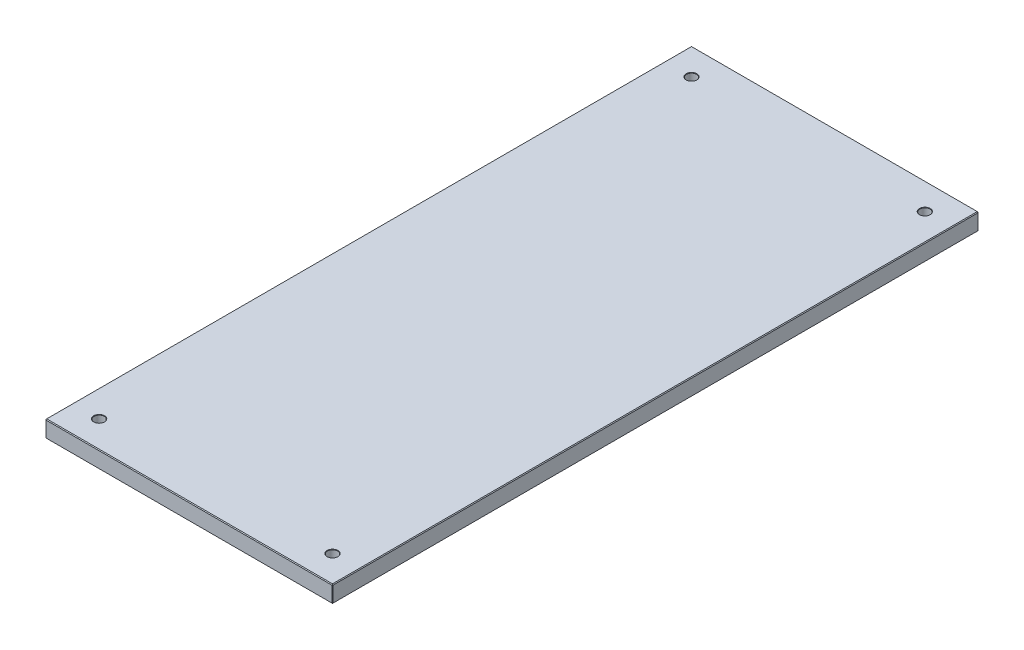
ISO-10303-21;
HEADER;
FILE_DESCRIPTION(('STEP AP214'),'2;1');
FILE_NAME('part.step','',(''),(''),'','','');
FILE_SCHEMA(('AUTOMOTIVE_DESIGN { 1 0 10303 214 1 1 1 1 }'));
ENDSEC;
DATA;
#1=APPLICATION_CONTEXT('core data for automotive mechanical design processes');
#2=APPLICATION_PROTOCOL_DEFINITION('international standard','automotive_design',2000,#1);
#3=PRODUCT_CONTEXT('',#1,'mechanical');
#4=PRODUCT('Part','Part','',(#3));
#5=PRODUCT_RELATED_PRODUCT_CATEGORY('part','',(#4));
#6=PRODUCT_DEFINITION_FORMATION('','',#4);
#7=PRODUCT_DEFINITION_CONTEXT('part definition',#1,'design');
#8=PRODUCT_DEFINITION('design','',#6,#7);
#9=PRODUCT_DEFINITION_SHAPE('','',#8);
#10=(LENGTH_UNIT() NAMED_UNIT(*) SI_UNIT(.MILLI.,.METRE.));
#11=(NAMED_UNIT(*) PLANE_ANGLE_UNIT() SI_UNIT($,.RADIAN.));
#12=(NAMED_UNIT(*) SI_UNIT($,.STERADIAN.) SOLID_ANGLE_UNIT());
#13=UNCERTAINTY_MEASURE_WITH_UNIT(LENGTH_MEASURE(1.E-05),#10,'distance_accuracy_value','');
#14=(GEOMETRIC_REPRESENTATION_CONTEXT(3) GLOBAL_UNCERTAINTY_ASSIGNED_CONTEXT((#13)) GLOBAL_UNIT_ASSIGNED_CONTEXT((#10,
#11,#12)) REPRESENTATION_CONTEXT('',''));
#15=CARTESIAN_POINT('',(0.,0.,0.));
#16=DIRECTION('',(0.,0.,1.));
#17=DIRECTION('',(1.,0.,0.));
#18=AXIS2_PLACEMENT_3D('',#15,#16,#17);
#19=CARTESIAN_POINT('',(101.6,6.,228.6));
#20=DIRECTION('',(-1.,0.,0.));
#21=DIRECTION('',(0.,0.,1.));
#22=AXIS2_PLACEMENT_3D('',#19,#20,#21);
#23=PLANE('',#22);
#24=DIRECTION('',(0.,0.,-1.));
#25=VECTOR('',#24,1.);
#26=CARTESIAN_POINT('',(101.6,-5.49199999999999,-228.6));
#27=LINE('',#26,#25);
#28=CARTESIAN_POINT('',(101.6,-5.49199999999999,228.092));
#29=VERTEX_POINT('',#28);
#30=CARTESIAN_POINT('',(101.6,-5.49199999999999,-228.092));
#31=VERTEX_POINT('',#30);
#32=EDGE_CURVE('E193',#29,#31,#27,.T.);
#33=ORIENTED_EDGE('',*,*,#32,.T.);
#34=DIRECTION('',(0.,1.,0.));
#35=VECTOR('',#34,1.);
#36=CARTESIAN_POINT('',(101.6,6.,-228.092));
#37=LINE('',#36,#35);
#38=CARTESIAN_POINT('',(101.6,5.49199999999999,-228.092));
#39=VERTEX_POINT('',#38);
#40=EDGE_CURVE('E200',#31,#39,#37,.T.);
#41=ORIENTED_EDGE('',*,*,#40,.T.);
#42=DIRECTION('',(0.,0.,1.));
#43=VECTOR('',#42,1.);
#44=CARTESIAN_POINT('',(101.6,5.49199999999999,228.6));
#45=LINE('',#44,#43);
#46=CARTESIAN_POINT('',(101.6,5.49199999999999,228.092));
#47=VERTEX_POINT('',#46);
#48=EDGE_CURVE('E196',#39,#47,#45,.T.);
#49=ORIENTED_EDGE('',*,*,#48,.T.);
#50=DIRECTION('',(0.,-1.,0.));
#51=VECTOR('',#50,1.);
#52=CARTESIAN_POINT('',(101.6,6.,228.092));
#53=LINE('',#52,#51);
#54=EDGE_CURVE('E190',#47,#29,#53,.T.);
#55=ORIENTED_EDGE('',*,*,#54,.T.);
#56=EDGE_LOOP('',(#33,#41,#49,#55));
#57=FACE_BOUND('',#56,.T.);
#58=ADVANCED_FACE('F47',(#57),#23,.F.);
#59=CARTESIAN_POINT('',(-101.6,6.,-228.6));
#60=DIRECTION('',(0.,0.,1.));
#61=DIRECTION('',(1.,0.,0.));
#62=AXIS2_PLACEMENT_3D('',#59,#60,#61);
#63=PLANE('',#62);
#64=DIRECTION('',(1.,0.,0.));
#65=VECTOR('',#64,1.);
#66=CARTESIAN_POINT('',(-101.6,5.49199999999999,-228.6));
#67=LINE('',#66,#65);
#68=CARTESIAN_POINT('',(-101.092,5.49199999999999,-228.6));
#69=VERTEX_POINT('',#68);
#70=CARTESIAN_POINT('',(101.092,5.49199999999999,-228.6));
#71=VERTEX_POINT('',#70);
#72=EDGE_CURVE('E222',#69,#71,#67,.T.);
#73=ORIENTED_EDGE('',*,*,#72,.T.);
#74=DIRECTION('',(0.,-1.,0.));
#75=VECTOR('',#74,1.);
#76=CARTESIAN_POINT('',(101.092,6.,-228.6));
#77=LINE('',#76,#75);
#78=CARTESIAN_POINT('',(101.092,-5.49199999999999,-228.6));
#79=VERTEX_POINT('',#78);
#80=EDGE_CURVE('E225',#71,#79,#77,.T.);
#81=ORIENTED_EDGE('',*,*,#80,.T.);
#82=DIRECTION('',(-1.,0.,0.));
#83=VECTOR('',#82,1.);
#84=CARTESIAN_POINT('',(-101.6,-5.49199999999999,-228.6));
#85=LINE('',#84,#83);
#86=CARTESIAN_POINT('',(-101.092,-5.49199999999999,-228.6));
#87=VERTEX_POINT('',#86);
#88=EDGE_CURVE('E219',#79,#87,#85,.T.);
#89=ORIENTED_EDGE('',*,*,#88,.T.);
#90=DIRECTION('',(0.,1.,0.));
#91=VECTOR('',#90,1.);
#92=CARTESIAN_POINT('',(-101.092,6.,-228.6));
#93=LINE('',#92,#91);
#94=EDGE_CURVE('E216',#87,#69,#93,.T.);
#95=ORIENTED_EDGE('',*,*,#94,.T.);
#96=EDGE_LOOP('',(#73,#81,#89,#95));
#97=FACE_BOUND('',#96,.T.);
#98=ADVANCED_FACE('F414',(#97),#63,.F.);
#99=CARTESIAN_POINT('',(-101.6,6.,228.6));
#100=DIRECTION('',(1.,0.,0.));
#101=DIRECTION('',(0.,0.,-1.));
#102=AXIS2_PLACEMENT_3D('',#99,#100,#101);
#103=PLANE('',#102);
#104=DIRECTION('',(0.,0.,-1.));
#105=VECTOR('',#104,1.);
#106=CARTESIAN_POINT('',(-101.6,5.49199999999999,228.6));
#107=LINE('',#106,#105);
#108=CARTESIAN_POINT('',(-101.6,5.49199999999999,228.092));
#109=VERTEX_POINT('',#108);
#110=CARTESIAN_POINT('',(-101.6,5.49199999999999,-228.092));
#111=VERTEX_POINT('',#110);
#112=EDGE_CURVE('E156',#109,#111,#107,.T.);
#113=ORIENTED_EDGE('',*,*,#112,.T.);
#114=DIRECTION('',(0.,-1.,0.));
#115=VECTOR('',#114,1.);
#116=CARTESIAN_POINT('',(-101.6,6.,-228.092));
#117=LINE('',#116,#115);
#118=CARTESIAN_POINT('',(-101.6,-5.49199999999999,-228.092));
#119=VERTEX_POINT('',#118);
#120=EDGE_CURVE('E237',#111,#119,#117,.T.);
#121=ORIENTED_EDGE('',*,*,#120,.T.);
#122=DIRECTION('',(0.,0.,1.));
#123=VECTOR('',#122,1.);
#124=CARTESIAN_POINT('',(-101.6,-5.49199999999999,228.6));
#125=LINE('',#124,#123);
#126=CARTESIAN_POINT('',(-101.6,-5.49199999999999,228.092));
#127=VERTEX_POINT('',#126);
#128=EDGE_CURVE('E232',#119,#127,#125,.T.);
#129=ORIENTED_EDGE('',*,*,#128,.T.);
#130=DIRECTION('',(0.,1.,0.));
#131=VECTOR('',#130,1.);
#132=CARTESIAN_POINT('',(-101.6,6.,228.092));
#133=LINE('',#132,#131);
#134=EDGE_CURVE('E229',#127,#109,#133,.T.);
#135=ORIENTED_EDGE('',*,*,#134,.T.);
#136=EDGE_LOOP('',(#113,#121,#129,#135));
#137=FACE_BOUND('',#136,.T.);
#138=ADVANCED_FACE('F410',(#137),#103,.F.);
#139=CARTESIAN_POINT('',(-101.6,6.,228.6));
#140=DIRECTION('',(0.,0.,-1.));
#141=DIRECTION('',(-1.,0.,0.));
#142=AXIS2_PLACEMENT_3D('',#139,#140,#141);
#143=PLANE('',#142);
#144=DIRECTION('',(-1.,0.,0.));
#145=VECTOR('',#144,1.);
#146=CARTESIAN_POINT('',(-101.6,5.49199999999999,228.6));
#147=LINE('',#146,#145);
#148=CARTESIAN_POINT('',(101.092,5.49199999999999,228.6));
#149=VERTEX_POINT('',#148);
#150=CARTESIAN_POINT('',(-101.092,5.49199999999999,228.6));
#151=VERTEX_POINT('',#150);
#152=EDGE_CURVE('E58',#149,#151,#147,.T.);
#153=ORIENTED_EDGE('',*,*,#152,.T.);
#154=DIRECTION('',(0.,-1.,0.));
#155=VECTOR('',#154,1.);
#156=CARTESIAN_POINT('',(-101.092,6.,228.6));
#157=LINE('',#156,#155);
#158=CARTESIAN_POINT('',(-101.092,-5.49199999999999,228.6));
#159=VERTEX_POINT('',#158);
#160=EDGE_CURVE('E11',#151,#159,#157,.T.);
#161=ORIENTED_EDGE('',*,*,#160,.T.);
#162=DIRECTION('',(1.,0.,0.));
#163=VECTOR('',#162,1.);
#164=CARTESIAN_POINT('',(101.6,-5.49199999999999,228.6));
#165=LINE('',#164,#163);
#166=CARTESIAN_POINT('',(101.092,-5.49199999999999,228.6));
#167=VERTEX_POINT('',#166);
#168=EDGE_CURVE('E241',#159,#167,#165,.T.);
#169=ORIENTED_EDGE('',*,*,#168,.T.);
#170=DIRECTION('',(0.,1.,0.));
#171=VECTOR('',#170,1.);
#172=CARTESIAN_POINT('',(101.092,6.,228.6));
#173=LINE('',#172,#171);
#174=EDGE_CURVE('E69',#167,#149,#173,.T.);
#175=ORIENTED_EDGE('',*,*,#174,.T.);
#176=EDGE_LOOP('',(#153,#161,#169,#175));
#177=FACE_BOUND('',#176,.T.);
#178=ADVANCED_FACE('F401',(#177),#143,.F.);
#179=CARTESIAN_POINT('',(0.,6.,0.));
#180=DIRECTION('',(0.,-1.,0.));
#181=DIRECTION('',(0.,0.,-1.));
#182=AXIS2_PLACEMENT_3D('',#179,#180,#181);
#183=PLANE('',#182);
#184=DIRECTION('',(1.,0.,0.));
#185=VECTOR('',#184,1.);
#186=CARTESIAN_POINT('',(0.,6.,228.092));
#187=LINE('',#186,#185);
#188=CARTESIAN_POINT('',(-101.092,6.,228.092));
#189=VERTEX_POINT('',#188);
#190=CARTESIAN_POINT('',(101.092,6.,228.092));
#191=VERTEX_POINT('',#190);
#192=EDGE_CURVE('E142',#189,#191,#187,.T.);
#193=ORIENTED_EDGE('',*,*,#192,.T.);
#194=DIRECTION('',(0.,0.,-1.));
#195=VECTOR('',#194,1.);
#196=CARTESIAN_POINT('',(101.092,6.,0.));
#197=LINE('',#196,#195);
#198=CARTESIAN_POINT('',(101.092,6.,-228.092));
#199=VERTEX_POINT('',#198);
#200=EDGE_CURVE('E187',#191,#199,#197,.T.);
#201=ORIENTED_EDGE('',*,*,#200,.T.);
#202=DIRECTION('',(-1.,0.,0.));
#203=VECTOR('',#202,1.);
#204=CARTESIAN_POINT('',(0.,6.,-228.092));
#205=LINE('',#204,#203);
#206=CARTESIAN_POINT('',(-101.092,6.,-228.092));
#207=VERTEX_POINT('',#206);
#208=EDGE_CURVE('E145',#199,#207,#205,.T.);
#209=ORIENTED_EDGE('',*,*,#208,.T.);
#210=DIRECTION('',(0.,0.,1.));
#211=VECTOR('',#210,1.);
#212=CARTESIAN_POINT('',(-101.092,6.,0.));
#213=LINE('',#212,#211);
#214=EDGE_CURVE('E136',#207,#189,#213,.T.);
#215=ORIENTED_EDGE('',*,*,#214,.T.);
#216=EDGE_LOOP('',(#193,#201,#209,#215));
#217=FACE_BOUND('',#216,.T.);
#218=CARTESIAN_POINT('',(-82.55,6.,-209.55));
#219=DIRECTION('',(0.,1.,0.));
#220=DIRECTION('',(0.,0.,1.));
#221=AXIS2_PLACEMENT_3D('',#218,#219,#220);
#222=CIRCLE('',#221,3.82523999999999);
#223=CARTESIAN_POINT('',(-82.55,6.,-205.72476));
#224=VERTEX_POINT('',#223);
#225=EDGE_CURVE('E331',#224,#224,#222,.T.);
#226=ORIENTED_EDGE('',*,*,#225,.F.);
#227=EDGE_LOOP('',(#226));
#228=FACE_BOUND('',#227,.T.);
#229=CARTESIAN_POINT('',(82.55,6.,-209.55));
#230=DIRECTION('',(0.,1.,0.));
#231=DIRECTION('',(0.,0.,1.));
#232=AXIS2_PLACEMENT_3D('',#229,#230,#231);
#233=CIRCLE('',#232,3.82523999999999);
#234=CARTESIAN_POINT('',(82.55,6.,-205.72476));
#235=VERTEX_POINT('',#234);
#236=EDGE_CURVE('E351',#235,#235,#233,.T.);
#237=ORIENTED_EDGE('',*,*,#236,.F.);
#238=EDGE_LOOP('',(#237));
#239=FACE_BOUND('',#238,.T.);
#240=CARTESIAN_POINT('',(82.55,6.,209.55));
#241=DIRECTION('',(0.,1.,0.));
#242=DIRECTION('',(0.,0.,1.));
#243=AXIS2_PLACEMENT_3D('',#240,#241,#242);
#244=CIRCLE('',#243,3.82523999999999);
#245=CARTESIAN_POINT('',(82.55,6.,213.37524));
#246=VERTEX_POINT('',#245);
#247=EDGE_CURVE('E367',#246,#246,#244,.T.);
#248=ORIENTED_EDGE('',*,*,#247,.F.);
#249=EDGE_LOOP('',(#248));
#250=FACE_BOUND('',#249,.T.);
#251=CARTESIAN_POINT('',(-82.55,6.,209.55));
#252=DIRECTION('',(0.,1.,0.));
#253=DIRECTION('',(0.,0.,1.));
#254=AXIS2_PLACEMENT_3D('',#251,#252,#253);
#255=CIRCLE('',#254,3.82523999999999);
#256=CARTESIAN_POINT('',(-82.55,6.,213.37524));
#257=VERTEX_POINT('',#256);
#258=EDGE_CURVE('E383',#257,#257,#255,.T.);
#259=ORIENTED_EDGE('',*,*,#258,.F.);
#260=EDGE_LOOP('',(#259));
#261=FACE_BOUND('',#260,.T.);
#262=ADVANCED_FACE('F138',(#217,#228,#239,#250,#261),#183,.F.);
#263=CARTESIAN_POINT('',(0.,-6.,0.));
#264=DIRECTION('',(0.,-1.,0.));
#265=DIRECTION('',(0.,0.,-1.));
#266=AXIS2_PLACEMENT_3D('',#263,#264,#265);
#267=PLANE('',#266);
#268=DIRECTION('',(1.,0.,0.));
#269=VECTOR('',#268,1.);
#270=CARTESIAN_POINT('',(101.6,-6.,-228.092));
#271=LINE('',#270,#269);
#272=CARTESIAN_POINT('',(-101.092,-6.,-228.092));
#273=VERTEX_POINT('',#272);
#274=CARTESIAN_POINT('',(101.092,-6.,-228.092));
#275=VERTEX_POINT('',#274);
#276=EDGE_CURVE('E209',#273,#275,#271,.T.);
#277=ORIENTED_EDGE('',*,*,#276,.T.);
#278=DIRECTION('',(0.,0.,1.));
#279=VECTOR('',#278,1.);
#280=CARTESIAN_POINT('',(101.092,-6.,228.6));
#281=LINE('',#280,#279);
#282=CARTESIAN_POINT('',(101.092,-6.,228.092));
#283=VERTEX_POINT('',#282);
#284=EDGE_CURVE('E212',#275,#283,#281,.T.);
#285=ORIENTED_EDGE('',*,*,#284,.T.);
#286=DIRECTION('',(-1.,0.,0.));
#287=VECTOR('',#286,1.);
#288=CARTESIAN_POINT('',(-101.6,-6.,228.092));
#289=LINE('',#288,#287);
#290=CARTESIAN_POINT('',(-101.092,-6.,228.092));
#291=VERTEX_POINT('',#290);
#292=EDGE_CURVE('E203',#283,#291,#289,.T.);
#293=ORIENTED_EDGE('',*,*,#292,.T.);
#294=DIRECTION('',(0.,0.,-1.));
#295=VECTOR('',#294,1.);
#296=CARTESIAN_POINT('',(-101.092,-6.,-228.6));
#297=LINE('',#296,#295);
#298=EDGE_CURVE('E206',#291,#273,#297,.T.);
#299=ORIENTED_EDGE('',*,*,#298,.T.);
#300=EDGE_LOOP('',(#277,#285,#293,#299));
#301=FACE_BOUND('',#300,.T.);
#302=CARTESIAN_POINT('',(-82.55,-6.,-209.55));
#303=DIRECTION('',(0.,1.,0.));
#304=DIRECTION('',(0.,0.,1.));
#305=AXIS2_PLACEMENT_3D('',#302,#303,#304);
#306=CIRCLE('',#305,3.82523999999999);
#307=CARTESIAN_POINT('',(-82.55,-6.,-205.72476));
#308=VERTEX_POINT('',#307);
#309=EDGE_CURVE('E324',#308,#308,#306,.T.);
#310=ORIENTED_EDGE('',*,*,#309,.T.);
#311=EDGE_LOOP('',(#310));
#312=FACE_BOUND('',#311,.T.);
#313=CARTESIAN_POINT('',(82.55,-6.,-209.55));
#314=DIRECTION('',(0.,1.,0.));
#315=DIRECTION('',(0.,0.,1.));
#316=AXIS2_PLACEMENT_3D('',#313,#314,#315);
#317=CIRCLE('',#316,3.82523999999999);
#318=CARTESIAN_POINT('',(82.55,-6.,-205.72476));
#319=VERTEX_POINT('',#318);
#320=EDGE_CURVE('E347',#319,#319,#317,.T.);
#321=ORIENTED_EDGE('',*,*,#320,.T.);
#322=EDGE_LOOP('',(#321));
#323=FACE_BOUND('',#322,.T.);
#324=CARTESIAN_POINT('',(82.55,-6.,209.55));
#325=DIRECTION('',(0.,1.,0.));
#326=DIRECTION('',(0.,0.,1.));
#327=AXIS2_PLACEMENT_3D('',#324,#325,#326);
#328=CIRCLE('',#327,3.82523999999999);
#329=CARTESIAN_POINT('',(82.55,-6.,213.37524));
#330=VERTEX_POINT('',#329);
#331=EDGE_CURVE('E363',#330,#330,#328,.T.);
#332=ORIENTED_EDGE('',*,*,#331,.T.);
#333=EDGE_LOOP('',(#332));
#334=FACE_BOUND('',#333,.T.);
#335=CARTESIAN_POINT('',(-82.55,-6.,209.55));
#336=DIRECTION('',(0.,1.,0.));
#337=DIRECTION('',(0.,0.,1.));
#338=AXIS2_PLACEMENT_3D('',#335,#336,#337);
#339=CIRCLE('',#338,3.82523999999999);
#340=CARTESIAN_POINT('',(-82.55,-6.,213.37524));
#341=VERTEX_POINT('',#340);
#342=EDGE_CURVE('E379',#341,#341,#339,.T.);
#343=ORIENTED_EDGE('',*,*,#342,.T.);
#344=EDGE_LOOP('',(#343));
#345=FACE_BOUND('',#344,.T.);
#346=ADVANCED_FACE('F400',(#301,#312,#323,#334,#345),#267,.T.);
#347=CARTESIAN_POINT('',(-82.55,-5.746,209.55));
#348=DIRECTION('',(0.,-1.,0.));
#349=DIRECTION('',(0.,0.,-1.));
#350=AXIS2_PLACEMENT_3D('',#347,#348,#349);
#351=CONICAL_SURFACE('',#350,3.57124,0.785398163397421);
#352=ORIENTED_EDGE('',*,*,#342,.F.);
#353=EDGE_LOOP('',(#352));
#354=FACE_BOUND('',#353,.T.);
#355=CARTESIAN_POINT('',(-82.55,-5.746,209.55));
#356=DIRECTION('',(0.,1.,0.));
#357=DIRECTION('',(0.,0.,1.));
#358=AXIS2_PLACEMENT_3D('',#355,#356,#357);
#359=CIRCLE('',#358,3.57124);
#360=CARTESIAN_POINT('',(-82.55,-5.746,213.12124));
#361=VERTEX_POINT('',#360);
#362=EDGE_CURVE('E177',#361,#361,#359,.T.);
#363=ORIENTED_EDGE('',*,*,#362,.T.);
#364=EDGE_LOOP('',(#363));
#365=FACE_BOUND('',#364,.T.);
#366=ADVANCED_FACE('F407',(#354,#365),#351,.F.);
#367=CARTESIAN_POINT('',(-82.55,6.,209.55));
#368=DIRECTION('',(0.,1.,0.));
#369=DIRECTION('',(0.,0.,1.));
#370=AXIS2_PLACEMENT_3D('',#367,#368,#369);
#371=CYLINDRICAL_SURFACE('',#370,3.57124);
#372=ORIENTED_EDGE('',*,*,#362,.F.);
#373=EDGE_LOOP('',(#372));
#374=FACE_BOUND('',#373,.T.);
#375=CARTESIAN_POINT('',(-82.55,5.746,209.55));
#376=DIRECTION('',(0.,1.,0.));
#377=DIRECTION('',(0.,0.,1.));
#378=AXIS2_PLACEMENT_3D('',#375,#376,#377);
#379=CIRCLE('',#378,3.57124);
#380=CARTESIAN_POINT('',(-82.55,5.746,213.12124));
#381=VERTEX_POINT('',#380);
#382=EDGE_CURVE('E181',#381,#381,#379,.T.);
#383=ORIENTED_EDGE('',*,*,#382,.T.);
#384=EDGE_LOOP('',(#383));
#385=FACE_BOUND('',#384,.T.);
#386=ADVANCED_FACE('F390',(#374,#385),#371,.F.);
#387=CARTESIAN_POINT('',(-82.55,6.,209.55));
#388=DIRECTION('',(0.,1.,0.));
#389=DIRECTION('',(0.,0.,1.));
#390=AXIS2_PLACEMENT_3D('',#387,#388,#389);
#391=CONICAL_SURFACE('',#390,3.82523999999999,0.785398163397428);
#392=ORIENTED_EDGE('',*,*,#382,.F.);
#393=EDGE_LOOP('',(#392));
#394=FACE_BOUND('',#393,.T.);
#395=ORIENTED_EDGE('',*,*,#258,.T.);
#396=EDGE_LOOP('',(#395));
#397=FACE_BOUND('',#396,.T.);
#398=ADVANCED_FACE('F392',(#394,#397),#391,.F.);
#399=CARTESIAN_POINT('',(82.55,-5.746,209.55));
#400=DIRECTION('',(0.,-1.,0.));
#401=DIRECTION('',(0.,0.,-1.));
#402=AXIS2_PLACEMENT_3D('',#399,#400,#401);
#403=CONICAL_SURFACE('',#402,3.57124,0.785398163397421);
#404=ORIENTED_EDGE('',*,*,#331,.F.);
#405=EDGE_LOOP('',(#404));
#406=FACE_BOUND('',#405,.T.);
#407=CARTESIAN_POINT('',(82.55,-5.746,209.55));
#408=DIRECTION('',(0.,1.,0.));
#409=DIRECTION('',(0.,0.,1.));
#410=AXIS2_PLACEMENT_3D('',#407,#408,#409);
#411=CIRCLE('',#410,3.57124);
#412=CARTESIAN_POINT('',(82.55,-5.746,213.12124));
#413=VERTEX_POINT('',#412);
#414=EDGE_CURVE('E375',#413,#413,#411,.T.);
#415=ORIENTED_EDGE('',*,*,#414,.T.);
#416=EDGE_LOOP('',(#415));
#417=FACE_BOUND('',#416,.T.);
#418=ADVANCED_FACE('F395',(#406,#417),#403,.F.);
#419=CARTESIAN_POINT('',(82.55,6.,209.55));
#420=DIRECTION('',(0.,1.,0.));
#421=DIRECTION('',(0.,0.,1.));
#422=AXIS2_PLACEMENT_3D('',#419,#420,#421);
#423=CYLINDRICAL_SURFACE('',#422,3.57124);
#424=ORIENTED_EDGE('',*,*,#414,.F.);
#425=EDGE_LOOP('',(#424));
#426=FACE_BOUND('',#425,.T.);
#427=CARTESIAN_POINT('',(82.55,5.746,209.55));
#428=DIRECTION('',(0.,1.,0.));
#429=DIRECTION('',(0.,0.,1.));
#430=AXIS2_PLACEMENT_3D('',#427,#428,#429);
#431=CIRCLE('',#430,3.57124);
#432=CARTESIAN_POINT('',(82.55,5.746,213.12124));
#433=VERTEX_POINT('',#432);
#434=EDGE_CURVE('E371',#433,#433,#431,.T.);
#435=ORIENTED_EDGE('',*,*,#434,.T.);
#436=EDGE_LOOP('',(#435));
#437=FACE_BOUND('',#436,.T.);
#438=ADVANCED_FACE('F599',(#426,#437),#423,.F.);
#439=CARTESIAN_POINT('',(82.55,6.,209.55));
#440=DIRECTION('',(0.,1.,0.));
#441=DIRECTION('',(0.,0.,1.));
#442=AXIS2_PLACEMENT_3D('',#439,#440,#441);
#443=CONICAL_SURFACE('',#442,3.82523999999999,0.785398163397428);
#444=ORIENTED_EDGE('',*,*,#434,.F.);
#445=EDGE_LOOP('',(#444));
#446=FACE_BOUND('',#445,.T.);
#447=ORIENTED_EDGE('',*,*,#247,.T.);
#448=EDGE_LOOP('',(#447));
#449=FACE_BOUND('',#448,.T.);
#450=ADVANCED_FACE('F603',(#446,#449),#443,.F.);
#451=CARTESIAN_POINT('',(82.55,-5.746,-209.55));
#452=DIRECTION('',(0.,-1.,0.));
#453=DIRECTION('',(0.,0.,-1.));
#454=AXIS2_PLACEMENT_3D('',#451,#452,#453);
#455=CONICAL_SURFACE('',#454,3.57124,0.785398163397421);
#456=ORIENTED_EDGE('',*,*,#320,.F.);
#457=EDGE_LOOP('',(#456));
#458=FACE_BOUND('',#457,.T.);
#459=CARTESIAN_POINT('',(82.55,-5.746,-209.55));
#460=DIRECTION('',(0.,1.,0.));
#461=DIRECTION('',(0.,0.,1.));
#462=AXIS2_PLACEMENT_3D('',#459,#460,#461);
#463=CIRCLE('',#462,3.57124);
#464=CARTESIAN_POINT('',(82.55,-5.746,-205.97876));
#465=VERTEX_POINT('',#464);
#466=EDGE_CURVE('E359',#465,#465,#463,.T.);
#467=ORIENTED_EDGE('',*,*,#466,.T.);
#468=EDGE_LOOP('',(#467));
#469=FACE_BOUND('',#468,.T.);
#470=ADVANCED_FACE('F607',(#458,#469),#455,.F.);
#471=CARTESIAN_POINT('',(82.55,6.,-209.55));
#472=DIRECTION('',(0.,1.,0.));
#473=DIRECTION('',(0.,0.,1.));
#474=AXIS2_PLACEMENT_3D('',#471,#472,#473);
#475=CYLINDRICAL_SURFACE('',#474,3.57124);
#476=ORIENTED_EDGE('',*,*,#466,.F.);
#477=EDGE_LOOP('',(#476));
#478=FACE_BOUND('',#477,.T.);
#479=CARTESIAN_POINT('',(82.55,5.746,-209.55));
#480=DIRECTION('',(0.,1.,0.));
#481=DIRECTION('',(0.,0.,1.));
#482=AXIS2_PLACEMENT_3D('',#479,#480,#481);
#483=CIRCLE('',#482,3.57124);
#484=CARTESIAN_POINT('',(82.55,5.746,-205.97876));
#485=VERTEX_POINT('',#484);
#486=EDGE_CURVE('E355',#485,#485,#483,.T.);
#487=ORIENTED_EDGE('',*,*,#486,.T.);
#488=EDGE_LOOP('',(#487));
#489=FACE_BOUND('',#488,.T.);
#490=ADVANCED_FACE('F611',(#478,#489),#475,.F.);
#491=CARTESIAN_POINT('',(82.55,6.,-209.55));
#492=DIRECTION('',(0.,1.,0.));
#493=DIRECTION('',(0.,0.,1.));
#494=AXIS2_PLACEMENT_3D('',#491,#492,#493);
#495=CONICAL_SURFACE('',#494,3.82523999999999,0.785398163397428);
#496=ORIENTED_EDGE('',*,*,#486,.F.);
#497=EDGE_LOOP('',(#496));
#498=FACE_BOUND('',#497,.T.);
#499=ORIENTED_EDGE('',*,*,#236,.T.);
#500=EDGE_LOOP('',(#499));
#501=FACE_BOUND('',#500,.T.);
#502=ADVANCED_FACE('F615',(#498,#501),#495,.F.);
#503=CARTESIAN_POINT('',(-82.55,-5.746,-209.55));
#504=DIRECTION('',(0.,-1.,0.));
#505=DIRECTION('',(0.,0.,-1.));
#506=AXIS2_PLACEMENT_3D('',#503,#504,#505);
#507=CONICAL_SURFACE('',#506,3.57124,0.785398163397421);
#508=ORIENTED_EDGE('',*,*,#309,.F.);
#509=EDGE_LOOP('',(#508));
#510=FACE_BOUND('',#509,.T.);
#511=CARTESIAN_POINT('',(-82.55,-5.746,-209.55));
#512=DIRECTION('',(0.,1.,0.));
#513=DIRECTION('',(0.,0.,1.));
#514=AXIS2_PLACEMENT_3D('',#511,#512,#513);
#515=CIRCLE('',#514,3.57124);
#516=CARTESIAN_POINT('',(-82.55,-5.746,-205.97876));
#517=VERTEX_POINT('',#516);
#518=EDGE_CURVE('E343',#517,#517,#515,.T.);
#519=ORIENTED_EDGE('',*,*,#518,.T.);
#520=EDGE_LOOP('',(#519));
#521=FACE_BOUND('',#520,.T.);
#522=ADVANCED_FACE('F619',(#510,#521),#507,.F.);
#523=CARTESIAN_POINT('',(-82.55,6.,-209.55));
#524=DIRECTION('',(0.,1.,0.));
#525=DIRECTION('',(0.,0.,1.));
#526=AXIS2_PLACEMENT_3D('',#523,#524,#525);
#527=CYLINDRICAL_SURFACE('',#526,3.57124);
#528=ORIENTED_EDGE('',*,*,#518,.F.);
#529=EDGE_LOOP('',(#528));
#530=FACE_BOUND('',#529,.T.);
#531=CARTESIAN_POINT('',(-82.55,5.746,-209.55));
#532=DIRECTION('',(0.,1.,0.));
#533=DIRECTION('',(0.,0.,1.));
#534=AXIS2_PLACEMENT_3D('',#531,#532,#533);
#535=CIRCLE('',#534,3.57124);
#536=CARTESIAN_POINT('',(-82.55,5.746,-205.97876));
#537=VERTEX_POINT('',#536);
#538=EDGE_CURVE('E337',#537,#537,#535,.T.);
#539=ORIENTED_EDGE('',*,*,#538,.T.);
#540=EDGE_LOOP('',(#539));
#541=FACE_BOUND('',#540,.T.);
#542=ADVANCED_FACE('F623',(#530,#541),#527,.F.);
#543=CARTESIAN_POINT('',(-82.55,6.,-209.55));
#544=DIRECTION('',(0.,1.,0.));
#545=DIRECTION('',(0.,0.,1.));
#546=AXIS2_PLACEMENT_3D('',#543,#544,#545);
#547=CONICAL_SURFACE('',#546,3.82523999999999,0.785398163397428);
#548=ORIENTED_EDGE('',*,*,#538,.F.);
#549=EDGE_LOOP('',(#548));
#550=FACE_BOUND('',#549,.T.);
#551=ORIENTED_EDGE('',*,*,#225,.T.);
#552=EDGE_LOOP('',(#551));
#553=FACE_BOUND('',#552,.T.);
#554=ADVANCED_FACE('F551',(#550,#553),#547,.F.);
#555=CARTESIAN_POINT('',(-101.6,-5.49199999999999,228.6));
#556=DIRECTION('',(-0.707106781186547,-0.707106781186547,0.));
#557=DIRECTION('',(0.,0.,-1.));
#558=AXIS2_PLACEMENT_3D('',#555,#556,#557);
#559=PLANE('',#558);
#560=DIRECTION('',(0.707106781186547,-0.707106781186547,0.));
#561=VECTOR('',#560,1.);
#562=CARTESIAN_POINT('',(-101.6,-5.49199999999999,228.092));
#563=LINE('',#562,#561);
#564=EDGE_CURVE('E52',#127,#291,#563,.T.);
#565=ORIENTED_EDGE('',*,*,#564,.F.);
#566=ORIENTED_EDGE('',*,*,#128,.F.);
#567=DIRECTION('',(-0.707106781186547,0.707106781186547,0.));
#568=VECTOR('',#567,1.);
#569=CARTESIAN_POINT('',(-101.346,-5.746,-228.092));
#570=LINE('',#569,#568);
#571=EDGE_CURVE('E314',#273,#119,#570,.T.);
#572=ORIENTED_EDGE('',*,*,#571,.F.);
#573=ORIENTED_EDGE('',*,*,#298,.F.);
#574=EDGE_LOOP('',(#565,#566,#572,#573));
#575=FACE_BOUND('',#574,.T.);
#576=ADVANCED_FACE('F50',(#575),#559,.T.);
#577=CARTESIAN_POINT('',(-101.6,-5.49199999999999,228.092));
#578=DIRECTION('',(-0.577350269189626,-0.577350269189626,0.577350269189626));
#579=DIRECTION('',(0.707106781186547,0.,0.707106781186547));
#580=AXIS2_PLACEMENT_3D('',#577,#578,#579);
#581=PLANE('',#580);
#582=DIRECTION('',(0.707106781186547,0.,0.707106781186547));
#583=VECTOR('',#582,1.);
#584=CARTESIAN_POINT('',(-101.6,-5.49199999999999,228.092));
#585=LINE('',#584,#583);
#586=EDGE_CURVE('E307',#127,#159,#585,.T.);
#587=ORIENTED_EDGE('',*,*,#586,.F.);
#588=ORIENTED_EDGE('',*,*,#564,.T.);
#589=DIRECTION('',(0.,0.707106781186547,0.707106781186547));
#590=VECTOR('',#589,1.);
#591=CARTESIAN_POINT('',(-101.092,-5.746,228.346));
#592=LINE('',#591,#590);
#593=EDGE_CURVE('E311',#159,#291,#592,.F.);
#594=ORIENTED_EDGE('',*,*,#593,.F.);
#595=EDGE_LOOP('',(#587,#588,#594));
#596=FACE_BOUND('',#595,.T.);
#597=ADVANCED_FACE('F544',(#596),#581,.T.);
#598=CARTESIAN_POINT('',(-101.092,-5.49199999999999,-228.6));
#599=DIRECTION('',(-0.577350269189626,-0.577350269189626,-0.577350269189626));
#600=DIRECTION('',(-0.707106781186547,0.,0.707106781186547));
#601=AXIS2_PLACEMENT_3D('',#598,#599,#600);
#602=PLANE('',#601);
#603=DIRECTION('',(0.,-0.707106781186547,0.707106781186547));
#604=VECTOR('',#603,1.);
#605=CARTESIAN_POINT('',(-101.092,-5.49199999999999,-228.6));
#606=LINE('',#605,#604);
#607=EDGE_CURVE('E300',#273,#87,#606,.F.);
#608=ORIENTED_EDGE('',*,*,#607,.F.);
#609=ORIENTED_EDGE('',*,*,#571,.T.);
#610=DIRECTION('',(-0.707106781186547,0.,0.707106781186547));
#611=VECTOR('',#610,1.);
#612=CARTESIAN_POINT('',(-101.092,-5.49199999999999,-228.6));
#613=LINE('',#612,#611);
#614=EDGE_CURVE('E304',#87,#119,#613,.T.);
#615=ORIENTED_EDGE('',*,*,#614,.F.);
#616=EDGE_LOOP('',(#608,#609,#615));
#617=FACE_BOUND('',#616,.T.);
#618=ADVANCED_FACE('F538',(#617),#602,.T.);
#619=CARTESIAN_POINT('',(-101.6,-5.49199999999999,228.6));
#620=DIRECTION('',(0.,-0.707106781186547,0.707106781186547));
#621=DIRECTION('',(-1.,0.,0.));
#622=AXIS2_PLACEMENT_3D('',#619,#620,#621);
#623=PLANE('',#622);
#624=ORIENTED_EDGE('',*,*,#593,.T.);
#625=ORIENTED_EDGE('',*,*,#292,.F.);
#626=DIRECTION('',(0.,-0.707106781186547,-0.707106781186547));
#627=VECTOR('',#626,1.);
#628=CARTESIAN_POINT('',(101.092,-6.,228.092));
#629=LINE('',#628,#627);
#630=EDGE_CURVE('E293',#167,#283,#629,.T.);
#631=ORIENTED_EDGE('',*,*,#630,.F.);
#632=ORIENTED_EDGE('',*,*,#168,.F.);
#633=EDGE_LOOP('',(#624,#625,#631,#632));
#634=FACE_BOUND('',#633,.T.);
#635=ADVANCED_FACE('F531',(#634),#623,.T.);
#636=CARTESIAN_POINT('',(-101.092,6.,228.6));
#637=DIRECTION('',(0.707106781186547,0.,-0.707106781186547));
#638=DIRECTION('',(0.,-1.,0.));
#639=AXIS2_PLACEMENT_3D('',#636,#637,#638);
#640=PLANE('',#639);
#641=ORIENTED_EDGE('',*,*,#586,.T.);
#642=ORIENTED_EDGE('',*,*,#160,.F.);
#643=DIRECTION('',(-0.707106781186547,0.,-0.707106781186547));
#644=VECTOR('',#643,1.);
#645=CARTESIAN_POINT('',(-101.346,5.49199999999999,228.346));
#646=LINE('',#645,#644);
#647=EDGE_CURVE('E161',#109,#151,#646,.F.);
#648=ORIENTED_EDGE('',*,*,#647,.F.);
#649=ORIENTED_EDGE('',*,*,#134,.F.);
#650=EDGE_LOOP('',(#641,#642,#648,#649));
#651=FACE_BOUND('',#650,.T.);
#652=ADVANCED_FACE('F525',(#651),#640,.F.);
#653=CARTESIAN_POINT('',(-101.092,6.,0.));
#654=DIRECTION('',(0.707106781186547,-0.707106781186547,0.));
#655=DIRECTION('',(0.,0.,1.));
#656=AXIS2_PLACEMENT_3D('',#653,#654,#655);
#657=PLANE('',#656);
#658=DIRECTION('',(-0.707106781186547,-0.707106781186547,0.));
#659=VECTOR('',#658,1.);
#660=CARTESIAN_POINT('',(-101.092,6.,-228.092));
#661=LINE('',#660,#659);
#662=EDGE_CURVE('E162',#111,#207,#661,.F.);
#663=ORIENTED_EDGE('',*,*,#662,.F.);
#664=ORIENTED_EDGE('',*,*,#112,.F.);
#665=DIRECTION('',(0.707106781186547,0.707106781186547,0.));
#666=VECTOR('',#665,1.);
#667=CARTESIAN_POINT('',(-101.092,6.,228.092));
#668=LINE('',#667,#666);
#669=EDGE_CURVE('E153',#189,#109,#668,.F.);
#670=ORIENTED_EDGE('',*,*,#669,.F.);
#671=ORIENTED_EDGE('',*,*,#214,.F.);
#672=EDGE_LOOP('',(#663,#664,#670,#671));
#673=FACE_BOUND('',#672,.T.);
#674=ADVANCED_FACE('F155',(#673),#657,.F.);
#675=CARTESIAN_POINT('',(-101.6,6.,-228.092));
#676=DIRECTION('',(0.707106781186547,0.,0.707106781186547));
#677=DIRECTION('',(0.,-1.,0.));
#678=AXIS2_PLACEMENT_3D('',#675,#676,#677);
#679=PLANE('',#678);
#680=ORIENTED_EDGE('',*,*,#614,.T.);
#681=ORIENTED_EDGE('',*,*,#120,.F.);
#682=DIRECTION('',(0.707106781186547,0.,-0.707106781186547));
#683=VECTOR('',#682,1.);
#684=CARTESIAN_POINT('',(-101.346,5.49199999999999,-228.346));
#685=LINE('',#684,#683);
#686=EDGE_CURVE('E285',#69,#111,#685,.F.);
#687=ORIENTED_EDGE('',*,*,#686,.F.);
#688=ORIENTED_EDGE('',*,*,#94,.F.);
#689=EDGE_LOOP('',(#680,#681,#687,#688));
#690=FACE_BOUND('',#689,.T.);
#691=ADVANCED_FACE('F512',(#690),#679,.F.);
#692=CARTESIAN_POINT('',(-101.6,-5.49199999999999,-228.6));
#693=DIRECTION('',(0.,-0.707106781186547,-0.707106781186547));
#694=DIRECTION('',(1.,0.,0.));
#695=AXIS2_PLACEMENT_3D('',#692,#693,#694);
#696=PLANE('',#695);
#697=ORIENTED_EDGE('',*,*,#607,.T.);
#698=ORIENTED_EDGE('',*,*,#88,.F.);
#699=DIRECTION('',(0.,0.707106781186547,-0.707106781186547));
#700=VECTOR('',#699,1.);
#701=CARTESIAN_POINT('',(101.092,-5.746,-228.346));
#702=LINE('',#701,#700);
#703=EDGE_CURVE('E281',#275,#79,#702,.T.);
#704=ORIENTED_EDGE('',*,*,#703,.F.);
#705=ORIENTED_EDGE('',*,*,#276,.F.);
#706=EDGE_LOOP('',(#697,#698,#704,#705));
#707=FACE_BOUND('',#706,.T.);
#708=ADVANCED_FACE('F505',(#707),#696,.T.);
#709=CARTESIAN_POINT('',(101.6,-5.49199999999999,228.6));
#710=DIRECTION('',(0.707106781186547,-0.707106781186547,0.));
#711=DIRECTION('',(0.,0.,1.));
#712=AXIS2_PLACEMENT_3D('',#709,#710,#711);
#713=PLANE('',#712);
#714=DIRECTION('',(0.707106781186547,0.707106781186547,0.));
#715=VECTOR('',#714,1.);
#716=CARTESIAN_POINT('',(101.092,-6.,228.092));
#717=LINE('',#716,#715);
#718=EDGE_CURVE('E296',#283,#29,#717,.T.);
#719=ORIENTED_EDGE('',*,*,#718,.F.);
#720=ORIENTED_EDGE('',*,*,#284,.F.);
#721=DIRECTION('',(-0.707106781186547,-0.707106781186547,0.));
#722=VECTOR('',#721,1.);
#723=CARTESIAN_POINT('',(101.6,-5.49199999999999,-228.092));
#724=LINE('',#723,#722);
#725=EDGE_CURVE('E277',#31,#275,#724,.T.);
#726=ORIENTED_EDGE('',*,*,#725,.F.);
#727=ORIENTED_EDGE('',*,*,#32,.F.);
#728=EDGE_LOOP('',(#719,#720,#726,#727));
#729=FACE_BOUND('',#728,.T.);
#730=ADVANCED_FACE('F498',(#729),#713,.T.);
#731=CARTESIAN_POINT('',(101.092,-6.,228.092));
#732=DIRECTION('',(0.577350269189626,-0.577350269189626,0.577350269189626));
#733=DIRECTION('',(0.707106781186547,0.,-0.707106781186547));
#734=AXIS2_PLACEMENT_3D('',#731,#732,#733);
#735=PLANE('',#734);
#736=ORIENTED_EDGE('',*,*,#630,.T.);
#737=ORIENTED_EDGE('',*,*,#718,.T.);
#738=DIRECTION('',(0.707106781186547,0.,-0.707106781186547));
#739=VECTOR('',#738,1.);
#740=CARTESIAN_POINT('',(101.346,-5.49199999999999,228.346));
#741=LINE('',#740,#739);
#742=EDGE_CURVE('E169',#167,#29,#741,.T.);
#743=ORIENTED_EDGE('',*,*,#742,.F.);
#744=EDGE_LOOP('',(#736,#737,#743));
#745=FACE_BOUND('',#744,.T.);
#746=ADVANCED_FACE('F492',(#745),#735,.T.);
#747=CARTESIAN_POINT('',(-101.092,6.,228.092));
#748=DIRECTION('',(-0.577350269189626,0.577350269189626,0.577350269189626));
#749=DIRECTION('',(0.707106781186547,0.,0.707106781186547));
#750=AXIS2_PLACEMENT_3D('',#747,#748,#749);
#751=PLANE('',#750);
#752=ORIENTED_EDGE('',*,*,#669,.T.);
#753=ORIENTED_EDGE('',*,*,#647,.T.);
#754=DIRECTION('',(0.,-0.707106781186547,0.707106781186547));
#755=VECTOR('',#754,1.);
#756=CARTESIAN_POINT('',(-101.092,6.,228.092));
#757=LINE('',#756,#755);
#758=EDGE_CURVE('E165',#189,#151,#757,.T.);
#759=ORIENTED_EDGE('',*,*,#758,.F.);
#760=EDGE_LOOP('',(#752,#753,#759));
#761=FACE_BOUND('',#760,.T.);
#762=ADVANCED_FACE('F166',(#761),#751,.T.);
#763=CARTESIAN_POINT('',(-101.092,6.,-228.092));
#764=DIRECTION('',(-0.577350269189626,0.577350269189626,-0.577350269189626));
#765=DIRECTION('',(-0.707106781186547,0.,0.707106781186547));
#766=AXIS2_PLACEMENT_3D('',#763,#764,#765);
#767=PLANE('',#766);
#768=ORIENTED_EDGE('',*,*,#686,.T.);
#769=ORIENTED_EDGE('',*,*,#662,.T.);
#770=DIRECTION('',(0.,0.707106781186547,0.707106781186547));
#771=VECTOR('',#770,1.);
#772=CARTESIAN_POINT('',(-101.092,6.,-228.092));
#773=LINE('',#772,#771);
#774=EDGE_CURVE('E170',#69,#207,#773,.T.);
#775=ORIENTED_EDGE('',*,*,#774,.F.);
#776=EDGE_LOOP('',(#768,#769,#775));
#777=FACE_BOUND('',#776,.T.);
#778=ADVANCED_FACE('F479',(#777),#767,.T.);
#779=CARTESIAN_POINT('',(101.6,-5.49199999999999,-228.092));
#780=DIRECTION('',(0.577350269189626,-0.577350269189626,-0.577350269189626));
#781=DIRECTION('',(-0.707106781186547,0.,-0.707106781186547));
#782=AXIS2_PLACEMENT_3D('',#779,#780,#781);
#783=PLANE('',#782);
#784=ORIENTED_EDGE('',*,*,#725,.T.);
#785=ORIENTED_EDGE('',*,*,#703,.T.);
#786=DIRECTION('',(-0.707106781186547,0.,-0.707106781186547));
#787=VECTOR('',#786,1.);
#788=CARTESIAN_POINT('',(101.6,-5.49199999999999,-228.092));
#789=LINE('',#788,#787);
#790=EDGE_CURVE('E268',#31,#79,#789,.T.);
#791=ORIENTED_EDGE('',*,*,#790,.F.);
#792=EDGE_LOOP('',(#784,#785,#791));
#793=FACE_BOUND('',#792,.T.);
#794=ADVANCED_FACE('F472',(#793),#783,.T.);
#795=CARTESIAN_POINT('',(101.6,6.,228.092));
#796=DIRECTION('',(-0.707106781186547,0.,-0.707106781186547));
#797=DIRECTION('',(0.,-1.,0.));
#798=AXIS2_PLACEMENT_3D('',#795,#796,#797);
#799=PLANE('',#798);
#800=ORIENTED_EDGE('',*,*,#742,.T.);
#801=ORIENTED_EDGE('',*,*,#54,.F.);
#802=DIRECTION('',(-0.707106781186547,0.,0.707106781186547));
#803=VECTOR('',#802,1.);
#804=CARTESIAN_POINT('',(101.6,5.49199999999999,228.092));
#805=LINE('',#804,#803);
#806=EDGE_CURVE('E264',#149,#47,#805,.F.);
#807=ORIENTED_EDGE('',*,*,#806,.F.);
#808=ORIENTED_EDGE('',*,*,#174,.F.);
#809=EDGE_LOOP('',(#800,#801,#807,#808));
#810=FACE_BOUND('',#809,.T.);
#811=ADVANCED_FACE('F466',(#810),#799,.F.);
#812=CARTESIAN_POINT('',(0.,6.,228.092));
#813=DIRECTION('',(0.,-0.707106781186547,-0.707106781186547));
#814=DIRECTION('',(1.,0.,0.));
#815=AXIS2_PLACEMENT_3D('',#812,#813,#814);
#816=PLANE('',#815);
#817=ORIENTED_EDGE('',*,*,#758,.T.);
#818=ORIENTED_EDGE('',*,*,#152,.F.);
#819=DIRECTION('',(0.,0.707106781186547,-0.707106781186547));
#820=VECTOR('',#819,1.);
#821=CARTESIAN_POINT('',(101.092,5.746,228.346));
#822=LINE('',#821,#820);
#823=EDGE_CURVE('E174',#191,#149,#822,.F.);
#824=ORIENTED_EDGE('',*,*,#823,.F.);
#825=ORIENTED_EDGE('',*,*,#192,.F.);
#826=EDGE_LOOP('',(#817,#818,#824,#825));
#827=FACE_BOUND('',#826,.T.);
#828=ADVANCED_FACE('F172',(#827),#816,.F.);
#829=CARTESIAN_POINT('',(0.,6.,-228.092));
#830=DIRECTION('',(0.,-0.707106781186547,0.707106781186547));
#831=DIRECTION('',(-1.,0.,0.));
#832=AXIS2_PLACEMENT_3D('',#829,#830,#831);
#833=PLANE('',#832);
#834=ORIENTED_EDGE('',*,*,#774,.T.);
#835=ORIENTED_EDGE('',*,*,#208,.F.);
#836=DIRECTION('',(0.,-0.707106781186547,-0.707106781186547));
#837=VECTOR('',#836,1.);
#838=CARTESIAN_POINT('',(101.092,6.,-228.092));
#839=LINE('',#838,#837);
#840=EDGE_CURVE('E258',#71,#199,#839,.F.);
#841=ORIENTED_EDGE('',*,*,#840,.F.);
#842=ORIENTED_EDGE('',*,*,#72,.F.);
#843=EDGE_LOOP('',(#834,#835,#841,#842));
#844=FACE_BOUND('',#843,.T.);
#845=ADVANCED_FACE('F453',(#844),#833,.F.);
#846=CARTESIAN_POINT('',(101.092,6.,-228.6));
#847=DIRECTION('',(-0.707106781186547,0.,0.707106781186547));
#848=DIRECTION('',(0.,-1.,0.));
#849=AXIS2_PLACEMENT_3D('',#846,#847,#848);
#850=PLANE('',#849);
#851=ORIENTED_EDGE('',*,*,#790,.T.);
#852=ORIENTED_EDGE('',*,*,#80,.F.);
#853=DIRECTION('',(0.707106781186547,0.,0.707106781186547));
#854=VECTOR('',#853,1.);
#855=CARTESIAN_POINT('',(101.346,5.49199999999999,-228.346));
#856=LINE('',#855,#854);
#857=EDGE_CURVE('E254',#39,#71,#856,.F.);
#858=ORIENTED_EDGE('',*,*,#857,.F.);
#859=ORIENTED_EDGE('',*,*,#40,.F.);
#860=EDGE_LOOP('',(#851,#852,#858,#859));
#861=FACE_BOUND('',#860,.T.);
#862=ADVANCED_FACE('F446',(#861),#850,.F.);
#863=CARTESIAN_POINT('',(101.6,5.49199999999999,228.092));
#864=DIRECTION('',(0.577350269189626,0.577350269189626,0.577350269189626));
#865=DIRECTION('',(0.707106781186547,0.,-0.707106781186547));
#866=AXIS2_PLACEMENT_3D('',#863,#864,#865);
#867=PLANE('',#866);
#868=ORIENTED_EDGE('',*,*,#823,.T.);
#869=ORIENTED_EDGE('',*,*,#806,.T.);
#870=DIRECTION('',(0.707106781186547,-0.707106781186547,0.));
#871=VECTOR('',#870,1.);
#872=CARTESIAN_POINT('',(101.6,5.49199999999999,228.092));
#873=LINE('',#872,#871);
#874=EDGE_CURVE('E251',#191,#47,#873,.T.);
#875=ORIENTED_EDGE('',*,*,#874,.F.);
#876=EDGE_LOOP('',(#868,#869,#875));
#877=FACE_BOUND('',#876,.T.);
#878=ADVANCED_FACE('F439',(#877),#867,.T.);
#879=CARTESIAN_POINT('',(101.092,6.,-228.092));
#880=DIRECTION('',(0.577350269189626,0.577350269189626,-0.577350269189626));
#881=DIRECTION('',(-0.707106781186547,0.,-0.707106781186547));
#882=AXIS2_PLACEMENT_3D('',#879,#880,#881);
#883=PLANE('',#882);
#884=ORIENTED_EDGE('',*,*,#857,.T.);
#885=ORIENTED_EDGE('',*,*,#840,.T.);
#886=DIRECTION('',(-0.707106781186547,0.707106781186547,0.));
#887=VECTOR('',#886,1.);
#888=CARTESIAN_POINT('',(101.092,6.,-228.092));
#889=LINE('',#888,#887);
#890=EDGE_CURVE('E248',#39,#199,#889,.T.);
#891=ORIENTED_EDGE('',*,*,#890,.F.);
#892=EDGE_LOOP('',(#884,#885,#891));
#893=FACE_BOUND('',#892,.T.);
#894=ADVANCED_FACE('F432',(#893),#883,.T.);
#895=CARTESIAN_POINT('',(101.092,6.,0.));
#896=DIRECTION('',(-0.707106781186547,-0.707106781186547,0.));
#897=DIRECTION('',(0.,0.,-1.));
#898=AXIS2_PLACEMENT_3D('',#895,#896,#897);
#899=PLANE('',#898);
#900=ORIENTED_EDGE('',*,*,#874,.T.);
#901=ORIENTED_EDGE('',*,*,#48,.F.);
#902=ORIENTED_EDGE('',*,*,#890,.T.);
#903=ORIENTED_EDGE('',*,*,#200,.F.);
#904=EDGE_LOOP('',(#900,#901,#902,#903));
#905=FACE_BOUND('',#904,.T.);
#906=ADVANCED_FACE('F426',(#905),#899,.F.);
#907=CLOSED_SHELL('',(#58,#98,#138,#178,#262,#346,#366,#386,#398,#418,#438,#450,#470,#490,#502,
#522,#542,#554,#576,#597,#618,#635,#652,#674,#691,#708,#730,#746,#762,#778,#794,#811,#828,#845,
#862,#878,#894,#906));
#908=MANIFOLD_SOLID_BREP('B2',#907);
#909=ADVANCED_BREP_SHAPE_REPRESENTATION('',(#18,#908),#14);
#910=SHAPE_DEFINITION_REPRESENTATION(#9,#909);
ENDSEC;
END-ISO-10303-21;
